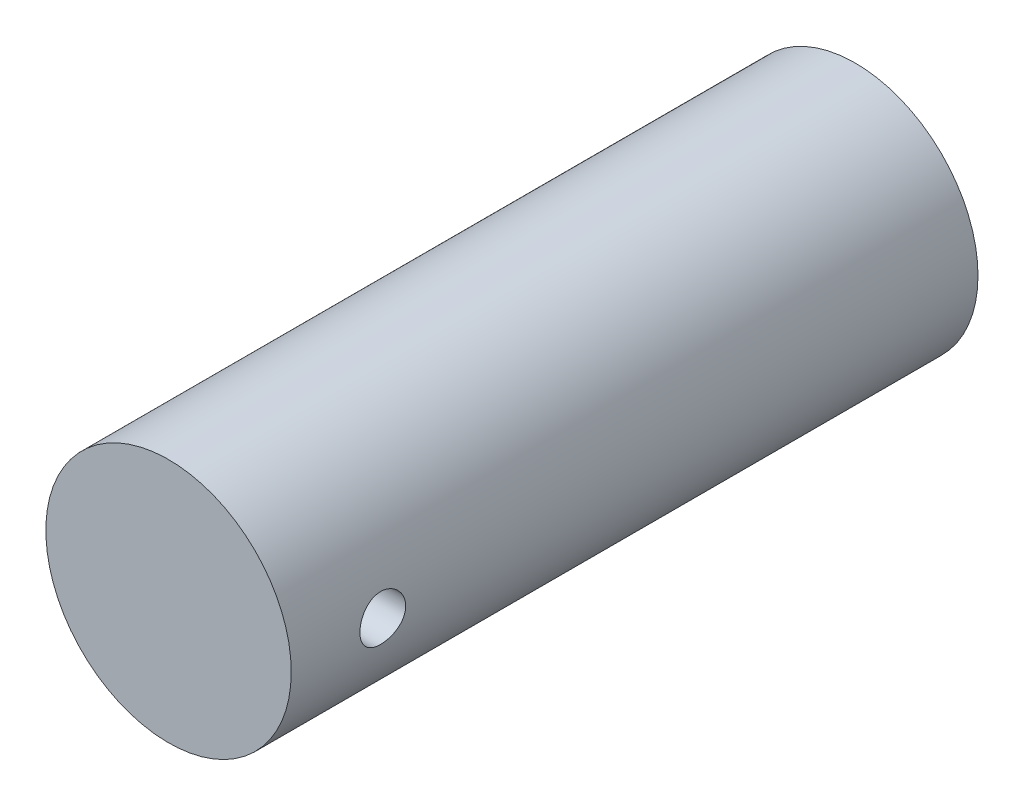
ISO-10303-21;
HEADER;
FILE_DESCRIPTION(('STEP AP214'),'2;1');
FILE_NAME('part.step','',(''),(''),'','','');
FILE_SCHEMA(('AUTOMOTIVE_DESIGN { 1 0 10303 214 1 1 1 1 }'));
ENDSEC;
DATA;
#1=APPLICATION_CONTEXT('core data for automotive mechanical design processes');
#2=APPLICATION_PROTOCOL_DEFINITION('international standard','automotive_design',2000,#1);
#3=PRODUCT_CONTEXT('',#1,'mechanical');
#4=PRODUCT('Part','Part','',(#3));
#5=PRODUCT_RELATED_PRODUCT_CATEGORY('part','',(#4));
#6=PRODUCT_DEFINITION_FORMATION('','',#4);
#7=PRODUCT_DEFINITION_CONTEXT('part definition',#1,'design');
#8=PRODUCT_DEFINITION('design','',#6,#7);
#9=PRODUCT_DEFINITION_SHAPE('','',#8);
#10=(LENGTH_UNIT() NAMED_UNIT(*) SI_UNIT(.MILLI.,.METRE.));
#11=(NAMED_UNIT(*) PLANE_ANGLE_UNIT() SI_UNIT($,.RADIAN.));
#12=(NAMED_UNIT(*) SI_UNIT($,.STERADIAN.) SOLID_ANGLE_UNIT());
#13=UNCERTAINTY_MEASURE_WITH_UNIT(LENGTH_MEASURE(1.E-05),#10,'distance_accuracy_value','');
#14=(GEOMETRIC_REPRESENTATION_CONTEXT(3) GLOBAL_UNCERTAINTY_ASSIGNED_CONTEXT((#13)) GLOBAL_UNIT_ASSIGNED_CONTEXT((#10,
#11,#12)) REPRESENTATION_CONTEXT('',''));
#15=CARTESIAN_POINT('',(0.,0.,0.));
#16=DIRECTION('',(0.,0.,1.));
#17=DIRECTION('',(1.,0.,0.));
#18=AXIS2_PLACEMENT_3D('',#15,#16,#17);
#19=CARTESIAN_POINT('',(0.,0.,47.625));
#20=DIRECTION('',(0.,0.,-1.));
#21=DIRECTION('',(-1.,0.,0.));
#22=AXIS2_PLACEMENT_3D('',#19,#20,#21);
#23=CYLINDRICAL_SURFACE('',#22,8.509);
#24=CARTESIAN_POINT('',(0.,0.,47.625));
#25=DIRECTION('',(0.,0.,1.));
#26=DIRECTION('',(1.,0.,0.));
#27=AXIS2_PLACEMENT_3D('',#24,#25,#26);
#28=CIRCLE('',#27,8.509);
#29=CARTESIAN_POINT('',(8.509,0.,47.625));
#30=VERTEX_POINT('',#29);
#31=EDGE_CURVE('E10',#30,#30,#28,.T.);
#32=ORIENTED_EDGE('',*,*,#31,.F.);
#33=EDGE_LOOP('',(#32));
#34=FACE_BOUND('',#33,.T.);
#35=CARTESIAN_POINT('',(0.,0.,0.));
#36=DIRECTION('',(0.,0.,1.));
#37=DIRECTION('',(1.,0.,0.));
#38=AXIS2_PLACEMENT_3D('',#35,#36,#37);
#39=CIRCLE('',#38,8.509);
#40=CARTESIAN_POINT('',(8.509,0.,0.));
#41=VERTEX_POINT('',#40);
#42=EDGE_CURVE('E50',#41,#41,#39,.T.);
#43=ORIENTED_EDGE('',*,*,#42,.T.);
#44=EDGE_LOOP('',(#43));
#45=FACE_BOUND('',#44,.T.);
#46=CARTESIAN_POINT('',(8.509,0.,42.8625));
#47=CARTESIAN_POINT('',(8.50899840287789,-0.0883490584258998,42.86249661549));
#48=CARTESIAN_POINT('',(8.50760979296225,-0.176742245279739,42.8550997492599));
#49=CARTESIAN_POINT('',(8.50220418974004,-0.351038301642841,42.8257264535026));
#50=CARTESIAN_POINT('',(8.49818496882266,-0.436938996060258,42.8037376672657));
#51=CARTESIAN_POINT('',(8.4879678009925,-0.603704113521514,42.7458767959224));
#52=CARTESIAN_POINT('',(8.48177181347841,-0.684572989110684,42.710017193595));
#53=CARTESIAN_POINT('',(8.46787792627516,-0.839138826981299,42.6254679169743));
#54=CARTESIAN_POINT('',(8.46018015051701,-0.912836380305042,42.5767793012444));
#55=CARTESIAN_POINT('',(8.44403040917822,-1.05184935936863,42.4673409460066));
#56=CARTESIAN_POINT('',(8.43557129985889,-1.11706741402319,42.4064685632822));
#57=CARTESIAN_POINT('',(8.41890538412066,-1.23642779848546,42.2746544469641));
#58=CARTESIAN_POINT('',(8.41069859575298,-1.29056933743125,42.2037119949809));
#59=CARTESIAN_POINT('',(8.39539709718418,-1.38664410919884,42.0530843099341));
#60=CARTESIAN_POINT('',(8.38831159864429,-1.42847842173276,41.9733349645158));
#61=CARTESIAN_POINT('',(8.37615550848895,-1.49811800146932,41.8077858159139));
#62=CARTESIAN_POINT('',(8.37108474492283,-1.52592446595489,41.721986529808));
#63=CARTESIAN_POINT('',(8.36360411762246,-1.56640679562062,41.5478144377496));
#64=CARTESIAN_POINT('',(8.361164428238,-1.57925239244257,41.4594823883701));
#65=CARTESIAN_POINT('',(8.35913224265225,-1.58997515733712,41.2818856809709));
#66=CARTESIAN_POINT('',(8.35953949368966,-1.5878536542409,41.1926211064465));
#67=CARTESIAN_POINT('',(8.36312801647945,-1.56884010082255,41.0169220777743));
#68=CARTESIAN_POINT('',(8.36627305965146,-1.55214094517762,40.9304659000562));
#69=CARTESIAN_POINT('',(8.37492590318637,-1.50474984449326,40.7616042076382));
#70=CARTESIAN_POINT('',(8.38043380304632,-1.47405731020608,40.6791988636768));
#71=CARTESIAN_POINT('',(8.39322968990999,-1.39936173123737,40.5202130085925));
#72=CARTESIAN_POINT('',(8.40052805772938,-1.35528069422079,40.4436700102345));
#73=CARTESIAN_POINT('',(8.41607565790507,-1.25511457742285,40.2989945128524));
#74=CARTESIAN_POINT('',(8.42432498579847,-1.19902829106219,40.230862860291));
#75=CARTESIAN_POINT('',(8.44100293472271,-1.07540323914774,40.1038294708339));
#76=CARTESIAN_POINT('',(8.44943234514008,-1.00769946035319,40.0450883055));
#77=CARTESIAN_POINT('',(8.46540237593212,-0.863313730711623,39.9397733670674));
#78=CARTESIAN_POINT('',(8.47294298756219,-0.786631691545275,39.8931997136753));
#79=CARTESIAN_POINT('',(8.48630079256618,-0.626299444877622,39.8135186237095));
#80=CARTESIAN_POINT('',(8.49211586139719,-0.542640808500917,39.7804277690448));
#81=CARTESIAN_POINT('',(8.50135093458623,-0.370819785471935,39.7288133217889));
#82=CARTESIAN_POINT('',(8.50477119080197,-0.282657873466926,39.7102881973234));
#83=CARTESIAN_POINT('',(8.50879670769442,-0.10571446639103,39.6885542957477));
#84=CARTESIAN_POINT('',(8.50944240399475,-0.0169608872252193,39.685125490974));
#85=CARTESIAN_POINT('',(8.50795769955892,0.159851459475614,39.6930915271012));
#86=CARTESIAN_POINT('',(8.50582743380843,0.247910260585876,39.7044856472132));
#87=CARTESIAN_POINT('',(8.49905533803246,0.420136349368182,39.7415911623114));
#88=CARTESIAN_POINT('',(8.49443302634753,0.504328433453783,39.7671913368802));
#89=CARTESIAN_POINT('',(8.48319299293892,0.667225556542881,39.8318619932));
#90=CARTESIAN_POINT('',(8.47657513679003,0.745930225459578,39.8709333824332));
#91=CARTESIAN_POINT('',(8.46197723986642,0.896558191395699,39.9619251595676));
#92=CARTESIAN_POINT('',(8.45398322140858,0.968398805054012,40.0139801335138));
#93=CARTESIAN_POINT('',(8.43755607451344,1.10240399058102,40.1292791696428));
#94=CARTESIAN_POINT('',(8.42912290555958,1.16456766752551,40.1925242655351));
#95=CARTESIAN_POINT('',(8.41263394210339,1.27828948481995,40.3294039280577));
#96=CARTESIAN_POINT('',(8.40458456220727,1.32969753856653,40.403164090105));
#97=CARTESIAN_POINT('',(8.38990322749197,1.41939392744706,40.5584023697153));
#98=CARTESIAN_POINT('',(8.38327122032354,1.4576827471583,40.6398802020733));
#99=CARTESIAN_POINT('',(8.37222577472697,1.51984045265676,40.8078581265975));
#100=CARTESIAN_POINT('',(8.36780172748488,1.54377840549647,40.8943319314056));
#101=CARTESIAN_POINT('',(8.3616487611619,1.57676808028992,41.0701643278011));
#102=CARTESIAN_POINT('',(8.35991954137325,1.58582146317464,41.1595225963839));
#103=CARTESIAN_POINT('',(8.35936716368943,1.58872986150101,41.3370842138377));
#104=CARTESIAN_POINT('',(8.36049874203205,1.58282159876807,41.4252836314533));
#105=CARTESIAN_POINT('',(8.36544014755995,1.55649238355075,41.5994086061311));
#106=CARTESIAN_POINT('',(8.36924995912117,1.5360715157289,41.6853341764553));
#107=CARTESIAN_POINT('',(8.37909958640034,1.48139621858897,41.8523466899446));
#108=CARTESIAN_POINT('',(8.38513530785296,1.44716717678889,41.933442201249));
#109=CARTESIAN_POINT('',(8.39875962380401,1.36587298140659,42.0887772350407));
#110=CARTESIAN_POINT('',(8.40634832649395,1.31880693343284,42.1630162793354));
#111=CARTESIAN_POINT('',(8.42236419714436,1.21235074357323,42.3037172695304));
#112=CARTESIAN_POINT('',(8.43080212799476,1.15278823243352,42.3700475956387));
#113=CARTESIAN_POINT('',(8.44748494306784,1.02338950452211,42.4918510737184));
#114=CARTESIAN_POINT('',(8.45572978249388,0.95355093057397,42.5473217278201));
#115=CARTESIAN_POINT('',(8.47118347560362,0.804838075371775,42.6462920403802));
#116=CARTESIAN_POINT('',(8.4783824553848,0.725888904574986,42.6896807570586));
#117=CARTESIAN_POINT('',(8.49083690325014,0.56171290166232,42.7625092110546));
#118=CARTESIAN_POINT('',(8.4960942010223,0.476492070769351,42.7919620878059));
#119=CARTESIAN_POINT('',(8.5029975272798,0.3258473446325,42.8300830853276));
#120=CARTESIAN_POINT('',(8.50523577477178,0.261305670738154,42.8422187146789));
#121=CARTESIAN_POINT('',(8.50823758568179,0.131184091241589,42.8584283278751));
#122=CARTESIAN_POINT('',(8.5090011859542,0.0656042116274985,42.8625025131916));
#123=CARTESIAN_POINT('',(8.509,0.,42.8625));
#124=B_SPLINE_CURVE_WITH_KNOTS('',3,(#46,#47,#48,#49,#50,#51,#52,#53,#54,#55,#56,#57,#58,#59,
#60,#61,#62,#63,#64,#65,#66,#67,#68,#69,#70,#71,#72,#73,#74,#75,#76,#77,#78,#79,#80,#81,#82,#83,
#84,#85,#86,#87,#88,#89,#90,#91,#92,#93,#94,#95,#96,#97,#98,#99,#100,#101,#102,#103,#104,#105,
#106,#107,#108,#109,#110,#111,#112,#113,#114,#115,#116,#117,#118,#119,#120,#121,#122,#123),
.UNSPECIFIED.,.T.,.F.,(4,2,2,2,2,2,2,2,2,2,2,2,2,2,2,2,2,2,2,2,2,2,2,2,2,2,2,2,2,2,2,2,2,2,2,2,
2,2,4),(0.,0.264807261950686,0.52983905426631,0.794632889057389,1.05940488169114,
1.32698984298112,1.59459390314321,1.86429350586092,2.13397008570411,2.40055641678741,
2.66711907970698,2.93020709603329,3.193306191767,3.45796831656155,3.72265705353997,
3.99147503640632,4.26029566386277,4.52944591139869,4.79856784868113,5.06375408831079,
5.32892743330879,5.59205342082101,5.85519713716241,6.12119100753722,6.38720946246006,
6.65672332808816,6.92622723777048,7.19442345837355,7.46258974961653,7.72653973408672,
7.99048817875804,8.2539535273105,8.51743723695054,8.78482730395678,9.05227880217621,
9.32211074438596,9.59168776555155,9.7883271655884,9.98496165115094),.UNSPECIFIED.);
#125=CARTESIAN_POINT('',(8.509,0.,42.8625));
#126=VERTEX_POINT('',#125);
#127=EDGE_CURVE('E57',#126,#126,#124,.T.);
#128=ORIENTED_EDGE('',*,*,#127,.F.);
#129=EDGE_LOOP('',(#128));
#130=FACE_BOUND('',#129,.T.);
#131=CARTESIAN_POINT('',(-8.509,0.,42.8625));
#132=CARTESIAN_POINT('',(-8.50899840287789,0.0883490584258998,42.86249661549));
#133=CARTESIAN_POINT('',(-8.50760979296225,0.176742245279739,42.8550997492599));
#134=CARTESIAN_POINT('',(-8.50220418974004,0.351038301642841,42.8257264535026));
#135=CARTESIAN_POINT('',(-8.49818496882266,0.436938996060258,42.8037376672657));
#136=CARTESIAN_POINT('',(-8.4879678009925,0.603704113521514,42.7458767959224));
#137=CARTESIAN_POINT('',(-8.48177181347841,0.684572989110684,42.710017193595));
#138=CARTESIAN_POINT('',(-8.46787792627516,0.839138826981299,42.6254679169743));
#139=CARTESIAN_POINT('',(-8.46018015051701,0.912836380305042,42.5767793012444));
#140=CARTESIAN_POINT('',(-8.44403040917822,1.05184935936863,42.4673409460066));
#141=CARTESIAN_POINT('',(-8.43557129985889,1.11706741402319,42.4064685632822));
#142=CARTESIAN_POINT('',(-8.41890538412066,1.23642779848546,42.2746544469641));
#143=CARTESIAN_POINT('',(-8.41069859575298,1.29056933743125,42.2037119949809));
#144=CARTESIAN_POINT('',(-8.39539709718418,1.38664410919884,42.0530843099341));
#145=CARTESIAN_POINT('',(-8.38831159864429,1.42847842173276,41.9733349645158));
#146=CARTESIAN_POINT('',(-8.37615550848895,1.49811800146932,41.8077858159139));
#147=CARTESIAN_POINT('',(-8.37108474492283,1.52592446595489,41.721986529808));
#148=CARTESIAN_POINT('',(-8.36360411762246,1.56640679562062,41.5478144377496));
#149=CARTESIAN_POINT('',(-8.361164428238,1.57925239244257,41.4594823883701));
#150=CARTESIAN_POINT('',(-8.35913224265225,1.58997515733712,41.2818856809709));
#151=CARTESIAN_POINT('',(-8.35953949368966,1.5878536542409,41.1926211064465));
#152=CARTESIAN_POINT('',(-8.36312801647945,1.56884010082255,41.0169220777743));
#153=CARTESIAN_POINT('',(-8.36627305965146,1.55214094517762,40.9304659000562));
#154=CARTESIAN_POINT('',(-8.37492590318637,1.50474984449326,40.7616042076382));
#155=CARTESIAN_POINT('',(-8.38043380304632,1.47405731020608,40.6791988636768));
#156=CARTESIAN_POINT('',(-8.39322968990999,1.39936173123737,40.5202130085925));
#157=CARTESIAN_POINT('',(-8.40052805772938,1.35528069422079,40.4436700102345));
#158=CARTESIAN_POINT('',(-8.41607565790507,1.25511457742285,40.2989945128524));
#159=CARTESIAN_POINT('',(-8.42432498579847,1.19902829106219,40.230862860291));
#160=CARTESIAN_POINT('',(-8.44100293472271,1.07540323914774,40.1038294708339));
#161=CARTESIAN_POINT('',(-8.44943234514008,1.00769946035319,40.0450883055));
#162=CARTESIAN_POINT('',(-8.46540237593212,0.863313730711623,39.9397733670674));
#163=CARTESIAN_POINT('',(-8.47294298756219,0.786631691545275,39.8931997136753));
#164=CARTESIAN_POINT('',(-8.48630079256618,0.626299444877622,39.8135186237095));
#165=CARTESIAN_POINT('',(-8.49211586139719,0.542640808500917,39.7804277690448));
#166=CARTESIAN_POINT('',(-8.50135093458623,0.370819785471935,39.7288133217889));
#167=CARTESIAN_POINT('',(-8.50477119080197,0.282657873466926,39.7102881973234));
#168=CARTESIAN_POINT('',(-8.50879670769442,0.10571446639103,39.6885542957477));
#169=CARTESIAN_POINT('',(-8.50944240399475,0.0169608872252193,39.685125490974));
#170=CARTESIAN_POINT('',(-8.50795769955892,-0.159851459475614,39.6930915271012));
#171=CARTESIAN_POINT('',(-8.50582743380843,-0.247910260585876,39.7044856472132));
#172=CARTESIAN_POINT('',(-8.49905533803246,-0.420136349368182,39.7415911623114));
#173=CARTESIAN_POINT('',(-8.49443302634753,-0.504328433453783,39.7671913368802));
#174=CARTESIAN_POINT('',(-8.48319299293892,-0.667225556542881,39.8318619932));
#175=CARTESIAN_POINT('',(-8.47657513679003,-0.745930225459578,39.8709333824332));
#176=CARTESIAN_POINT('',(-8.46197723986642,-0.896558191395699,39.9619251595676));
#177=CARTESIAN_POINT('',(-8.45398322140858,-0.968398805054012,40.0139801335138));
#178=CARTESIAN_POINT('',(-8.43755607451344,-1.10240399058102,40.1292791696428));
#179=CARTESIAN_POINT('',(-8.42912290555958,-1.16456766752551,40.1925242655351));
#180=CARTESIAN_POINT('',(-8.41263394210339,-1.27828948481995,40.3294039280577));
#181=CARTESIAN_POINT('',(-8.40458456220727,-1.32969753856653,40.403164090105));
#182=CARTESIAN_POINT('',(-8.38990322749197,-1.41939392744706,40.5584023697153));
#183=CARTESIAN_POINT('',(-8.38327122032354,-1.4576827471583,40.6398802020733));
#184=CARTESIAN_POINT('',(-8.37222577472697,-1.51984045265676,40.8078581265975));
#185=CARTESIAN_POINT('',(-8.36780172748488,-1.54377840549647,40.8943319314056));
#186=CARTESIAN_POINT('',(-8.3616487611619,-1.57676808028992,41.0701643278011));
#187=CARTESIAN_POINT('',(-8.35991954137325,-1.58582146317464,41.1595225963839));
#188=CARTESIAN_POINT('',(-8.35936716368943,-1.58872986150101,41.3370842138377));
#189=CARTESIAN_POINT('',(-8.36049874203205,-1.58282159876807,41.4252836314533));
#190=CARTESIAN_POINT('',(-8.36544014755995,-1.55649238355075,41.5994086061311));
#191=CARTESIAN_POINT('',(-8.36924995912117,-1.5360715157289,41.6853341764553));
#192=CARTESIAN_POINT('',(-8.37909958640034,-1.48139621858897,41.8523466899446));
#193=CARTESIAN_POINT('',(-8.38513530785296,-1.44716717678889,41.933442201249));
#194=CARTESIAN_POINT('',(-8.39875962380401,-1.36587298140659,42.0887772350407));
#195=CARTESIAN_POINT('',(-8.40634832649395,-1.31880693343284,42.1630162793354));
#196=CARTESIAN_POINT('',(-8.42236419714436,-1.21235074357323,42.3037172695304));
#197=CARTESIAN_POINT('',(-8.43080212799476,-1.15278823243352,42.3700475956387));
#198=CARTESIAN_POINT('',(-8.44748494306784,-1.02338950452211,42.4918510737184));
#199=CARTESIAN_POINT('',(-8.45572978249388,-0.95355093057397,42.5473217278201));
#200=CARTESIAN_POINT('',(-8.47118347560362,-0.804838075371775,42.6462920403802));
#201=CARTESIAN_POINT('',(-8.4783824553848,-0.725888904574986,42.6896807570586));
#202=CARTESIAN_POINT('',(-8.49083690325014,-0.56171290166232,42.7625092110546));
#203=CARTESIAN_POINT('',(-8.4960942010223,-0.476492070769351,42.7919620878059));
#204=CARTESIAN_POINT('',(-8.5029975272798,-0.3258473446325,42.8300830853276));
#205=CARTESIAN_POINT('',(-8.50523577477178,-0.261305670738154,42.8422187146789));
#206=CARTESIAN_POINT('',(-8.50823758568179,-0.131184091241589,42.8584283278751));
#207=CARTESIAN_POINT('',(-8.5090011859542,-0.0656042116274985,42.8625025131916));
#208=CARTESIAN_POINT('',(-8.509,0.,42.8625));
#209=B_SPLINE_CURVE_WITH_KNOTS('',3,(#131,#132,#133,#134,#135,#136,#137,#138,#139,#140,#141,
#142,#143,#144,#145,#146,#147,#148,#149,#150,#151,#152,#153,#154,#155,#156,#157,#158,#159,#160,
#161,#162,#163,#164,#165,#166,#167,#168,#169,#170,#171,#172,#173,#174,#175,#176,#177,#178,#179,
#180,#181,#182,#183,#184,#185,#186,#187,#188,#189,#190,#191,#192,#193,#194,#195,#196,#197,#198,
#199,#200,#201,#202,#203,#204,#205,#206,#207,#208),.UNSPECIFIED.,.T.,.F.,(4,2,2,2,2,2,2,2,2,2,2,
2,2,2,2,2,2,2,2,2,2,2,2,2,2,2,2,2,2,2,2,2,2,2,2,2,2,2,4),(0.,0.264807261950686,0.52983905426631,
0.794632889057389,1.05940488169114,1.32698984298112,1.59459390314321,1.86429350586092,
2.13397008570411,2.40055641678741,2.66711907970698,2.93020709603329,3.193306191767,
3.45796831656155,3.72265705353997,3.99147503640632,4.26029566386277,4.52944591139869,
4.79856784868113,5.06375408831079,5.32892743330879,5.59205342082101,5.85519713716241,
6.12119100753722,6.38720946246006,6.65672332808816,6.92622723777048,7.19442345837355,
7.46258974961653,7.72653973408672,7.99048817875804,8.2539535273105,8.51743723695054,
8.78482730395678,9.05227880217621,9.32211074438596,9.59168776555155,9.7883271655884,
9.98496165115094),.UNSPECIFIED.);
#210=CARTESIAN_POINT('',(-8.509,0.,42.8625));
#211=VERTEX_POINT('',#210);
#212=EDGE_CURVE('E41',#211,#211,#209,.T.);
#213=ORIENTED_EDGE('',*,*,#212,.F.);
#214=EDGE_LOOP('',(#213));
#215=FACE_BOUND('',#214,.T.);
#216=ADVANCED_FACE('F37',(#34,#45,#130,#215),#23,.T.);
#217=CARTESIAN_POINT('',(0.,0.,47.625));
#218=DIRECTION('',(0.,0.,1.));
#219=DIRECTION('',(1.,0.,0.));
#220=AXIS2_PLACEMENT_3D('',#217,#218,#219);
#221=PLANE('',#220);
#222=ORIENTED_EDGE('',*,*,#31,.T.);
#223=EDGE_LOOP('',(#222));
#224=FACE_BOUND('',#223,.T.);
#225=ADVANCED_FACE('F69',(#224),#221,.T.);
#226=CARTESIAN_POINT('',(0.,0.,0.));
#227=DIRECTION('',(0.,0.,1.));
#228=DIRECTION('',(1.,0.,0.));
#229=AXIS2_PLACEMENT_3D('',#226,#227,#228);
#230=PLANE('',#229);
#231=ORIENTED_EDGE('',*,*,#42,.F.);
#232=EDGE_LOOP('',(#231));
#233=FACE_BOUND('',#232,.T.);
#234=ADVANCED_FACE('F67',(#233),#230,.F.);
#235=CARTESIAN_POINT('',(47.625,0.,41.275));
#236=DIRECTION('',(-1.,0.,0.));
#237=DIRECTION('',(0.,0.,1.));
#238=AXIS2_PLACEMENT_3D('',#235,#236,#237);
#239=CYLINDRICAL_SURFACE('',#238,1.5875);
#240=ORIENTED_EDGE('',*,*,#127,.T.);
#241=EDGE_LOOP('',(#240));
#242=FACE_BOUND('',#241,.T.);
#243=ORIENTED_EDGE('',*,*,#212,.T.);
#244=EDGE_LOOP('',(#243));
#245=FACE_BOUND('',#244,.T.);
#246=ADVANCED_FACE('F63',(#242,#245),#239,.F.);
#247=CLOSED_SHELL('',(#216,#225,#234,#246));
#248=MANIFOLD_SOLID_BREP('B2',#247);
#249=ADVANCED_BREP_SHAPE_REPRESENTATION('',(#18,#248),#14);
#250=SHAPE_DEFINITION_REPRESENTATION(#9,#249);
ENDSEC;
END-ISO-10303-21;
